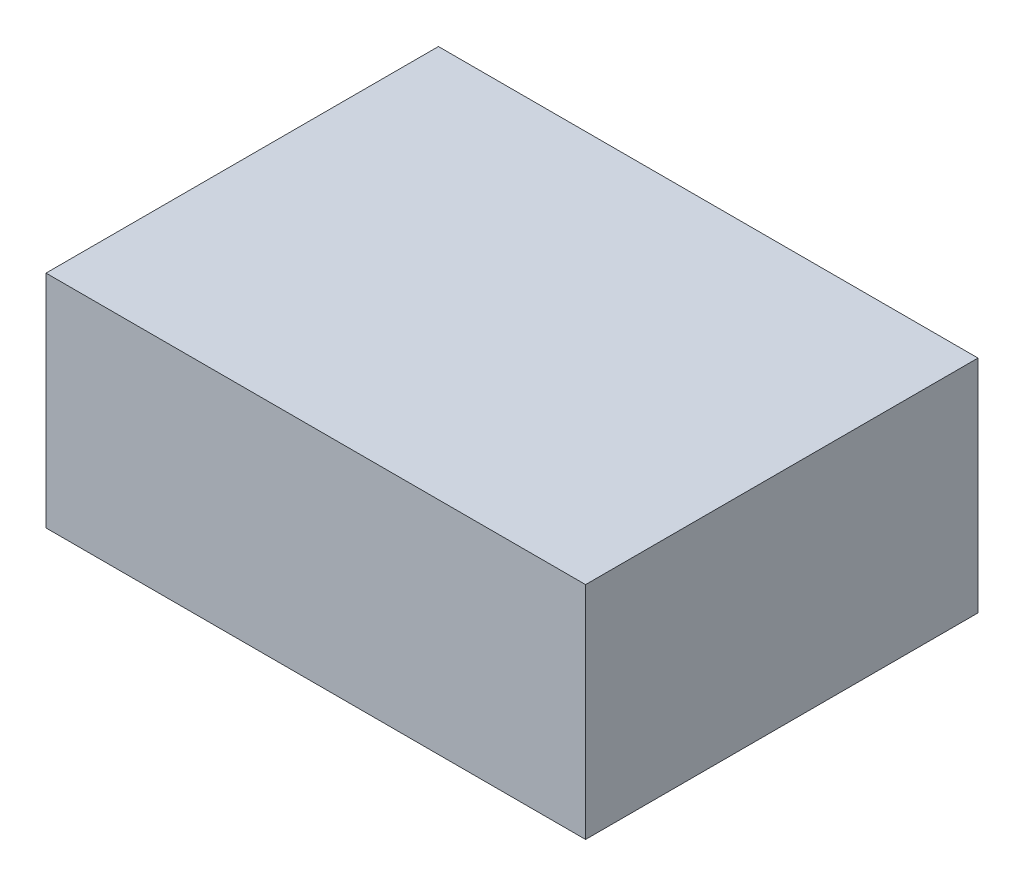
ISO-10303-21;
HEADER;
FILE_DESCRIPTION(('STEP AP214'),'2;1');
FILE_NAME('part.step','',(''),(''),'','','');
FILE_SCHEMA(('AUTOMOTIVE_DESIGN { 1 0 10303 214 1 1 1 1 }'));
ENDSEC;
DATA;
#1=APPLICATION_CONTEXT('core data for automotive mechanical design processes');
#2=APPLICATION_PROTOCOL_DEFINITION('international standard','automotive_design',2000,#1);
#3=PRODUCT_CONTEXT('',#1,'mechanical');
#4=PRODUCT('Part','Part','',(#3));
#5=PRODUCT_RELATED_PRODUCT_CATEGORY('part','',(#4));
#6=PRODUCT_DEFINITION_FORMATION('','',#4);
#7=PRODUCT_DEFINITION_CONTEXT('part definition',#1,'design');
#8=PRODUCT_DEFINITION('design','',#6,#7);
#9=PRODUCT_DEFINITION_SHAPE('','',#8);
#10=(LENGTH_UNIT() NAMED_UNIT(*) SI_UNIT(.MILLI.,.METRE.));
#11=(NAMED_UNIT(*) PLANE_ANGLE_UNIT() SI_UNIT($,.RADIAN.));
#12=(NAMED_UNIT(*) SI_UNIT($,.STERADIAN.) SOLID_ANGLE_UNIT());
#13=UNCERTAINTY_MEASURE_WITH_UNIT(LENGTH_MEASURE(1.E-05),#10,'distance_accuracy_value','');
#14=(GEOMETRIC_REPRESENTATION_CONTEXT(3) GLOBAL_UNCERTAINTY_ASSIGNED_CONTEXT((#13)) GLOBAL_UNIT_ASSIGNED_CONTEXT((#10,
#11,#12)) REPRESENTATION_CONTEXT('',''));
#15=CARTESIAN_POINT('',(0.,0.,0.));
#16=DIRECTION('',(0.,0.,1.));
#17=DIRECTION('',(1.,0.,0.));
#18=AXIS2_PLACEMENT_3D('',#15,#16,#17);
#19=CARTESIAN_POINT('',(-0.27500072,-0.11249914,0.));
#20=DIRECTION('',(0.,1.,0.));
#21=DIRECTION('',(0.,0.,1.));
#22=AXIS2_PLACEMENT_3D('',#19,#20,#21);
#23=PLANE('',#22);
#24=DIRECTION('',(0.,0.,1.));
#25=VECTOR('',#24,1.);
#26=CARTESIAN_POINT('',(0.27500072,-0.11249914,0.));
#27=LINE('',#26,#25);
#28=CARTESIAN_POINT('',(0.27500072,-0.11249914,0.));
#29=VERTEX_POINT('',#28);
#30=CARTESIAN_POINT('',(0.27500072,-0.11249914,0.3999992));
#31=VERTEX_POINT('',#30);
#32=EDGE_CURVE('E20',#29,#31,#27,.T.);
#33=ORIENTED_EDGE('',*,*,#32,.T.);
#34=DIRECTION('',(-1.,0.,0.));
#35=VECTOR('',#34,1.);
#36=CARTESIAN_POINT('',(0.27500072,-0.11249914,0.3999992));
#37=LINE('',#36,#35);
#38=CARTESIAN_POINT('',(-0.27500072,-0.11249914,0.3999992));
#39=VERTEX_POINT('',#38);
#40=EDGE_CURVE('E55',#31,#39,#37,.T.);
#41=ORIENTED_EDGE('',*,*,#40,.T.);
#42=DIRECTION('',(0.,0.,-1.));
#43=VECTOR('',#42,1.);
#44=CARTESIAN_POINT('',(-0.27500072,-0.11249914,0.));
#45=LINE('',#44,#43);
#46=CARTESIAN_POINT('',(-0.27500072,-0.11249914,0.));
#47=VERTEX_POINT('',#46);
#48=EDGE_CURVE('E76',#39,#47,#45,.T.);
#49=ORIENTED_EDGE('',*,*,#48,.T.);
#50=DIRECTION('',(-1.,0.,0.));
#51=VECTOR('',#50,1.);
#52=CARTESIAN_POINT('',(0.27500072,-0.11249914,0.));
#53=LINE('',#52,#51);
#54=EDGE_CURVE('E58',#29,#47,#53,.T.);
#55=ORIENTED_EDGE('',*,*,#54,.F.);
#56=EDGE_LOOP('',(#33,#41,#49,#55));
#57=FACE_BOUND('',#56,.T.);
#58=ADVANCED_FACE('F17',(#57),#23,.F.);
#59=CARTESIAN_POINT('',(0.27500072,-0.11249914,0.));
#60=DIRECTION('',(-1.,0.,0.));
#61=DIRECTION('',(0.,0.,1.));
#62=AXIS2_PLACEMENT_3D('',#59,#60,#61);
#63=PLANE('',#62);
#64=DIRECTION('',(0.,0.,-1.));
#65=VECTOR('',#64,1.);
#66=CARTESIAN_POINT('',(0.27500072,0.11249914,0.));
#67=LINE('',#66,#65);
#68=CARTESIAN_POINT('',(0.27500072,0.11249914,0.));
#69=VERTEX_POINT('',#68);
#70=CARTESIAN_POINT('',(0.27500072,0.11249914,0.3999992));
#71=VERTEX_POINT('',#70);
#72=EDGE_CURVE('E73',#69,#71,#67,.F.);
#73=ORIENTED_EDGE('',*,*,#72,.T.);
#74=DIRECTION('',(0.,1.,0.));
#75=VECTOR('',#74,1.);
#76=CARTESIAN_POINT('',(0.27500072,0.11249914,0.3999992));
#77=LINE('',#76,#75);
#78=EDGE_CURVE('E63',#71,#31,#77,.F.);
#79=ORIENTED_EDGE('',*,*,#78,.T.);
#80=ORIENTED_EDGE('',*,*,#32,.F.);
#81=DIRECTION('',(0.,1.,0.));
#82=VECTOR('',#81,1.);
#83=CARTESIAN_POINT('',(0.27500072,0.11249914,0.));
#84=LINE('',#83,#82);
#85=EDGE_CURVE('E78',#69,#29,#84,.F.);
#86=ORIENTED_EDGE('',*,*,#85,.F.);
#87=EDGE_LOOP('',(#73,#79,#80,#86));
#88=FACE_BOUND('',#87,.T.);
#89=ADVANCED_FACE('F72',(#88),#63,.F.);
#90=CARTESIAN_POINT('',(0.27500072,0.11249914,0.3999992));
#91=DIRECTION('',(0.,0.,-1.));
#92=DIRECTION('',(-1.,0.,0.));
#93=AXIS2_PLACEMENT_3D('',#90,#91,#92);
#94=PLANE('',#93);
#95=DIRECTION('',(0.,1.,0.));
#96=VECTOR('',#95,1.);
#97=CARTESIAN_POINT('',(-0.27500072,0.11249914,0.3999992));
#98=LINE('',#97,#96);
#99=CARTESIAN_POINT('',(-0.27500072,0.11249914,0.3999992));
#100=VERTEX_POINT('',#99);
#101=EDGE_CURVE('E69',#100,#39,#98,.F.);
#102=ORIENTED_EDGE('',*,*,#101,.T.);
#103=ORIENTED_EDGE('',*,*,#40,.F.);
#104=ORIENTED_EDGE('',*,*,#78,.F.);
#105=DIRECTION('',(1.,0.,0.));
#106=VECTOR('',#105,1.);
#107=CARTESIAN_POINT('',(0.27500072,0.11249914,0.3999992));
#108=LINE('',#107,#106);
#109=EDGE_CURVE('E83',#71,#100,#108,.F.);
#110=ORIENTED_EDGE('',*,*,#109,.T.);
#111=EDGE_LOOP('',(#102,#103,#104,#110));
#112=FACE_BOUND('',#111,.T.);
#113=ADVANCED_FACE('F66',(#112),#94,.F.);
#114=CARTESIAN_POINT('',(-0.27500072,0.11249914,0.));
#115=DIRECTION('',(1.,0.,0.));
#116=DIRECTION('',(0.,0.,-1.));
#117=AXIS2_PLACEMENT_3D('',#114,#115,#116);
#118=PLANE('',#117);
#119=ORIENTED_EDGE('',*,*,#48,.F.);
#120=ORIENTED_EDGE('',*,*,#101,.F.);
#121=DIRECTION('',(0.,0.,-1.));
#122=VECTOR('',#121,1.);
#123=CARTESIAN_POINT('',(-0.27500072,0.11249914,0.));
#124=LINE('',#123,#122);
#125=CARTESIAN_POINT('',(-0.27500072,0.11249914,0.));
#126=VERTEX_POINT('',#125);
#127=EDGE_CURVE('E26',#100,#126,#124,.T.);
#128=ORIENTED_EDGE('',*,*,#127,.T.);
#129=DIRECTION('',(0.,1.,0.));
#130=VECTOR('',#129,1.);
#131=CARTESIAN_POINT('',(-0.27500072,0.11249914,0.));
#132=LINE('',#131,#130);
#133=EDGE_CURVE('E34',#47,#126,#132,.T.);
#134=ORIENTED_EDGE('',*,*,#133,.F.);
#135=EDGE_LOOP('',(#119,#120,#128,#134));
#136=FACE_BOUND('',#135,.T.);
#137=ADVANCED_FACE('F88',(#136),#118,.F.);
#138=CARTESIAN_POINT('',(0.27500072,0.11249914,0.));
#139=DIRECTION('',(0.,0.,-1.));
#140=DIRECTION('',(-1.,0.,0.));
#141=AXIS2_PLACEMENT_3D('',#138,#139,#140);
#142=PLANE('',#141);
#143=ORIENTED_EDGE('',*,*,#133,.T.);
#144=DIRECTION('',(1.,0.,0.));
#145=VECTOR('',#144,1.);
#146=CARTESIAN_POINT('',(0.27500072,0.11249914,0.));
#147=LINE('',#146,#145);
#148=EDGE_CURVE('E11',#126,#69,#147,.T.);
#149=ORIENTED_EDGE('',*,*,#148,.T.);
#150=ORIENTED_EDGE('',*,*,#85,.T.);
#151=ORIENTED_EDGE('',*,*,#54,.T.);
#152=EDGE_LOOP('',(#143,#149,#150,#151));
#153=FACE_BOUND('',#152,.T.);
#154=ADVANCED_FACE('F91',(#153),#142,.T.);
#155=CARTESIAN_POINT('',(0.27500072,0.11249914,0.));
#156=DIRECTION('',(0.,-1.,0.));
#157=DIRECTION('',(0.,0.,-1.));
#158=AXIS2_PLACEMENT_3D('',#155,#156,#157);
#159=PLANE('',#158);
#160=ORIENTED_EDGE('',*,*,#127,.F.);
#161=ORIENTED_EDGE('',*,*,#109,.F.);
#162=ORIENTED_EDGE('',*,*,#72,.F.);
#163=ORIENTED_EDGE('',*,*,#148,.F.);
#164=EDGE_LOOP('',(#160,#161,#162,#163));
#165=FACE_BOUND('',#164,.T.);
#166=ADVANCED_FACE('F90',(#165),#159,.F.);
#167=CLOSED_SHELL('',(#58,#89,#113,#137,#154,#166));
#168=MANIFOLD_SOLID_BREP('B1',#167);
#169=ADVANCED_BREP_SHAPE_REPRESENTATION('',(#18,#168),#14);
#170=SHAPE_DEFINITION_REPRESENTATION(#9,#169);
ENDSEC;
END-ISO-10303-21;
